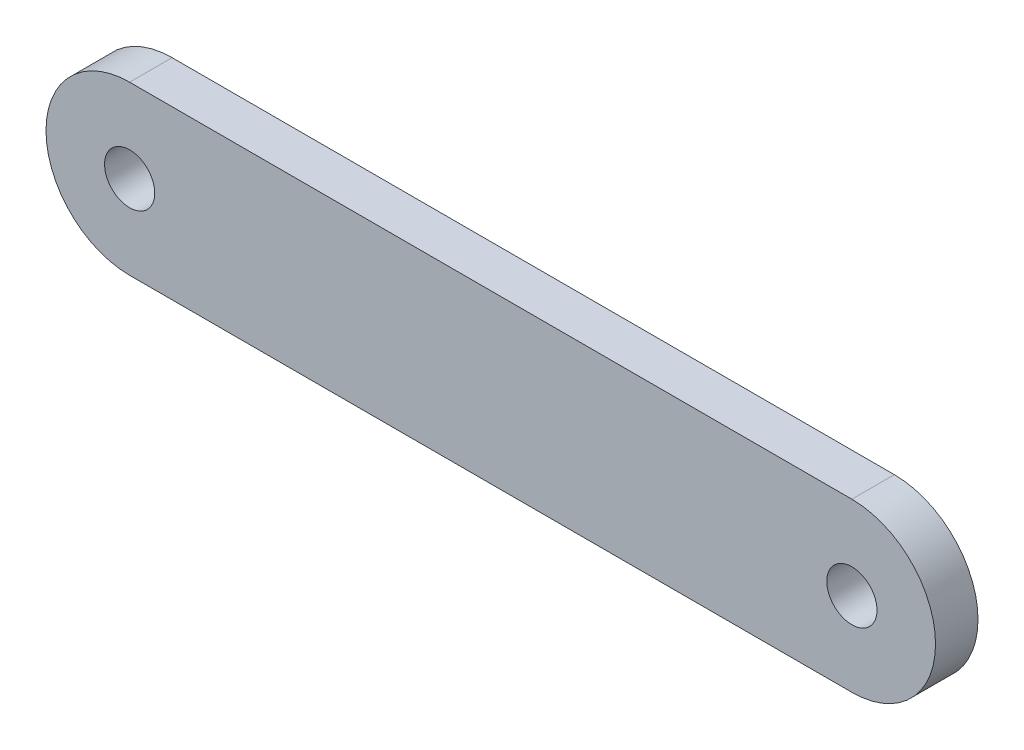
ISO-10303-21;
HEADER;
FILE_DESCRIPTION(('STEP AP214'),'2;1');
FILE_NAME('part.step','',(''),(''),'','','');
FILE_SCHEMA(('AUTOMOTIVE_DESIGN { 1 0 10303 214 1 1 1 1 }'));
ENDSEC;
DATA;
#1=APPLICATION_CONTEXT('core data for automotive mechanical design processes');
#2=APPLICATION_PROTOCOL_DEFINITION('international standard','automotive_design',2000,#1);
#3=PRODUCT_CONTEXT('',#1,'mechanical');
#4=PRODUCT('Part','Part','',(#3));
#5=PRODUCT_RELATED_PRODUCT_CATEGORY('part','',(#4));
#6=PRODUCT_DEFINITION_FORMATION('','',#4);
#7=PRODUCT_DEFINITION_CONTEXT('part definition',#1,'design');
#8=PRODUCT_DEFINITION('design','',#6,#7);
#9=PRODUCT_DEFINITION_SHAPE('','',#8);
#10=(LENGTH_UNIT() NAMED_UNIT(*) SI_UNIT(.MILLI.,.METRE.));
#11=(NAMED_UNIT(*) PLANE_ANGLE_UNIT() SI_UNIT($,.RADIAN.));
#12=(NAMED_UNIT(*) SI_UNIT($,.STERADIAN.) SOLID_ANGLE_UNIT());
#13=UNCERTAINTY_MEASURE_WITH_UNIT(LENGTH_MEASURE(1.E-05),#10,'distance_accuracy_value','');
#14=(GEOMETRIC_REPRESENTATION_CONTEXT(3) GLOBAL_UNCERTAINTY_ASSIGNED_CONTEXT((#13)) GLOBAL_UNIT_ASSIGNED_CONTEXT((#10,
#11,#12)) REPRESENTATION_CONTEXT('',''));
#15=CARTESIAN_POINT('',(0.,0.,0.));
#16=DIRECTION('',(0.,0.,1.));
#17=DIRECTION('',(1.,0.,0.));
#18=AXIS2_PLACEMENT_3D('',#15,#16,#17);
#19=CARTESIAN_POINT('',(-10.795,0.,0.635));
#20=DIRECTION('',(0.,0.,1.));
#21=DIRECTION('',(1.,0.,0.));
#22=AXIS2_PLACEMENT_3D('',#19,#20,#21);
#23=PLANE('',#22);
#24=CARTESIAN_POINT('',(-10.795,0.,0.635));
#25=DIRECTION('',(0.,0.,1.));
#26=DIRECTION('',(1.,0.,0.));
#27=AXIS2_PLACEMENT_3D('',#24,#25,#26);
#28=CIRCLE('',#27,0.75);
#29=CARTESIAN_POINT('',(-10.045,0.,0.635));
#30=VERTEX_POINT('',#29);
#31=EDGE_CURVE('E100',#30,#30,#28,.T.);
#32=ORIENTED_EDGE('',*,*,#31,.F.);
#33=EDGE_LOOP('',(#32));
#34=FACE_BOUND('',#33,.T.);
#35=CARTESIAN_POINT('',(-10.795,0.,0.635));
#36=DIRECTION('',(0.,0.,1.));
#37=DIRECTION('',(1.,0.,0.));
#38=AXIS2_PLACEMENT_3D('',#35,#36,#37);
#39=CIRCLE('',#38,2.5);
#40=CARTESIAN_POINT('',(-10.795,2.5,0.635));
#41=VERTEX_POINT('',#40);
#42=CARTESIAN_POINT('',(-10.795,-2.5,0.635));
#43=VERTEX_POINT('',#42);
#44=EDGE_CURVE('E85',#41,#43,#39,.T.);
#45=ORIENTED_EDGE('',*,*,#44,.T.);
#46=DIRECTION('',(1.,0.,0.));
#47=VECTOR('',#46,1.);
#48=CARTESIAN_POINT('',(-10.795,-2.5,0.635));
#49=LINE('',#48,#47);
#50=CARTESIAN_POINT('',(10.795,-2.5,0.635));
#51=VERTEX_POINT('',#50);
#52=EDGE_CURVE('E80',#43,#51,#49,.T.);
#53=ORIENTED_EDGE('',*,*,#52,.T.);
#54=CARTESIAN_POINT('',(10.795,0.,0.635));
#55=DIRECTION('',(0.,0.,1.));
#56=DIRECTION('',(1.,0.,0.));
#57=AXIS2_PLACEMENT_3D('',#54,#55,#56);
#58=CIRCLE('',#57,2.5);
#59=CARTESIAN_POINT('',(10.795,2.50000000000001,0.635));
#60=VERTEX_POINT('',#59);
#61=EDGE_CURVE('E83',#51,#60,#58,.T.);
#62=ORIENTED_EDGE('',*,*,#61,.T.);
#63=DIRECTION('',(-1.,0.,0.));
#64=VECTOR('',#63,1.);
#65=CARTESIAN_POINT('',(-10.795,2.5,0.635));
#66=LINE('',#65,#64);
#67=EDGE_CURVE('E50',#60,#41,#66,.T.);
#68=ORIENTED_EDGE('',*,*,#67,.T.);
#69=EDGE_LOOP('',(#45,#53,#62,#68));
#70=FACE_BOUND('',#69,.T.);
#71=CARTESIAN_POINT('',(10.795,0.,0.635));
#72=DIRECTION('',(0.,0.,1.));
#73=DIRECTION('',(1.,0.,0.));
#74=AXIS2_PLACEMENT_3D('',#71,#72,#73);
#75=CIRCLE('',#74,0.75);
#76=CARTESIAN_POINT('',(11.545,0.,0.635));
#77=VERTEX_POINT('',#76);
#78=EDGE_CURVE('E115',#77,#77,#75,.T.);
#79=ORIENTED_EDGE('',*,*,#78,.F.);
#80=EDGE_LOOP('',(#79));
#81=FACE_BOUND('',#80,.T.);
#82=ADVANCED_FACE('F33',(#34,#70,#81),#23,.T.);
#83=CARTESIAN_POINT('',(-10.795,0.,-0.635));
#84=DIRECTION('',(0.,0.,1.));
#85=DIRECTION('',(1.,0.,0.));
#86=AXIS2_PLACEMENT_3D('',#83,#84,#85);
#87=PLANE('',#86);
#88=CARTESIAN_POINT('',(-10.795,0.,-0.635));
#89=DIRECTION('',(0.,0.,1.));
#90=DIRECTION('',(1.,0.,0.));
#91=AXIS2_PLACEMENT_3D('',#88,#89,#90);
#92=CIRCLE('',#91,2.5);
#93=CARTESIAN_POINT('',(-10.795,2.5,-0.635));
#94=VERTEX_POINT('',#93);
#95=CARTESIAN_POINT('',(-10.795,-2.5,-0.635));
#96=VERTEX_POINT('',#95);
#97=EDGE_CURVE('E97',#94,#96,#92,.T.);
#98=ORIENTED_EDGE('',*,*,#97,.F.);
#99=DIRECTION('',(-1.,0.,0.));
#100=VECTOR('',#99,1.);
#101=CARTESIAN_POINT('',(-10.795,2.5,-0.635));
#102=LINE('',#101,#100);
#103=CARTESIAN_POINT('',(10.795,2.50000000000001,-0.635));
#104=VERTEX_POINT('',#103);
#105=EDGE_CURVE('E73',#104,#94,#102,.T.);
#106=ORIENTED_EDGE('',*,*,#105,.F.);
#107=CARTESIAN_POINT('',(10.795,0.,-0.635));
#108=DIRECTION('',(0.,0.,1.));
#109=DIRECTION('',(1.,0.,0.));
#110=AXIS2_PLACEMENT_3D('',#107,#108,#109);
#111=CIRCLE('',#110,2.5);
#112=CARTESIAN_POINT('',(10.795,-2.5,-0.635));
#113=VERTEX_POINT('',#112);
#114=EDGE_CURVE('E67',#113,#104,#111,.T.);
#115=ORIENTED_EDGE('',*,*,#114,.F.);
#116=DIRECTION('',(1.,0.,0.));
#117=VECTOR('',#116,1.);
#118=CARTESIAN_POINT('',(-10.795,-2.5,-0.635));
#119=LINE('',#118,#117);
#120=EDGE_CURVE('E89',#96,#113,#119,.T.);
#121=ORIENTED_EDGE('',*,*,#120,.F.);
#122=EDGE_LOOP('',(#98,#106,#115,#121));
#123=FACE_BOUND('',#122,.T.);
#124=CARTESIAN_POINT('',(-10.795,0.,-0.635));
#125=DIRECTION('',(0.,0.,1.));
#126=DIRECTION('',(1.,0.,0.));
#127=AXIS2_PLACEMENT_3D('',#124,#125,#126);
#128=CIRCLE('',#127,0.75);
#129=CARTESIAN_POINT('',(-10.045,0.,-0.635));
#130=VERTEX_POINT('',#129);
#131=EDGE_CURVE('E112',#130,#130,#128,.T.);
#132=ORIENTED_EDGE('',*,*,#131,.T.);
#133=EDGE_LOOP('',(#132));
#134=FACE_BOUND('',#133,.T.);
#135=CARTESIAN_POINT('',(10.795,0.,-0.635));
#136=DIRECTION('',(0.,0.,1.));
#137=DIRECTION('',(1.,0.,0.));
#138=AXIS2_PLACEMENT_3D('',#135,#136,#137);
#139=CIRCLE('',#138,0.75);
#140=CARTESIAN_POINT('',(11.545,0.,-0.635));
#141=VERTEX_POINT('',#140);
#142=EDGE_CURVE('E118',#141,#141,#139,.T.);
#143=ORIENTED_EDGE('',*,*,#142,.T.);
#144=EDGE_LOOP('',(#143));
#145=FACE_BOUND('',#144,.T.);
#146=ADVANCED_FACE('F108',(#123,#134,#145),#87,.F.);
#147=CARTESIAN_POINT('',(-10.795,0.,0.635));
#148=DIRECTION('',(0.,0.,-1.));
#149=DIRECTION('',(-1.,0.,0.));
#150=AXIS2_PLACEMENT_3D('',#147,#148,#149);
#151=CYLINDRICAL_SURFACE('',#150,2.5);
#152=ORIENTED_EDGE('',*,*,#97,.T.);
#153=DIRECTION('',(0.,0.,-1.));
#154=VECTOR('',#153,1.);
#155=CARTESIAN_POINT('',(-10.795,-2.5,0.635));
#156=LINE('',#155,#154);
#157=EDGE_CURVE('E11',#43,#96,#156,.T.);
#158=ORIENTED_EDGE('',*,*,#157,.F.);
#159=ORIENTED_EDGE('',*,*,#44,.F.);
#160=DIRECTION('',(0.,0.,-1.));
#161=VECTOR('',#160,1.);
#162=CARTESIAN_POINT('',(-10.795,2.5,0.635));
#163=LINE('',#162,#161);
#164=EDGE_CURVE('E93',#41,#94,#163,.T.);
#165=ORIENTED_EDGE('',*,*,#164,.T.);
#166=EDGE_LOOP('',(#152,#158,#159,#165));
#167=FACE_BOUND('',#166,.T.);
#168=ADVANCED_FACE('F35',(#167),#151,.T.);
#169=CARTESIAN_POINT('',(-10.795,-2.5,0.635));
#170=DIRECTION('',(0.,1.,0.));
#171=DIRECTION('',(-1.,0.,0.));
#172=AXIS2_PLACEMENT_3D('',#169,#170,#171);
#173=PLANE('',#172);
#174=ORIENTED_EDGE('',*,*,#120,.T.);
#175=DIRECTION('',(0.,0.,-1.));
#176=VECTOR('',#175,1.);
#177=CARTESIAN_POINT('',(10.795,-2.5,0.635));
#178=LINE('',#177,#176);
#179=EDGE_CURVE('E42',#51,#113,#178,.T.);
#180=ORIENTED_EDGE('',*,*,#179,.F.);
#181=ORIENTED_EDGE('',*,*,#52,.F.);
#182=ORIENTED_EDGE('',*,*,#157,.T.);
#183=EDGE_LOOP('',(#174,#180,#181,#182));
#184=FACE_BOUND('',#183,.T.);
#185=ADVANCED_FACE('F88',(#184),#173,.F.);
#186=CARTESIAN_POINT('',(10.795,0.,0.635));
#187=DIRECTION('',(0.,0.,-1.));
#188=DIRECTION('',(-1.,0.,0.));
#189=AXIS2_PLACEMENT_3D('',#186,#187,#188);
#190=CYLINDRICAL_SURFACE('',#189,2.5);
#191=ORIENTED_EDGE('',*,*,#114,.T.);
#192=DIRECTION('',(0.,0.,-1.));
#193=VECTOR('',#192,1.);
#194=CARTESIAN_POINT('',(10.795,2.50000000000001,0.635));
#195=LINE('',#194,#193);
#196=EDGE_CURVE('E90',#60,#104,#195,.T.);
#197=ORIENTED_EDGE('',*,*,#196,.F.);
#198=ORIENTED_EDGE('',*,*,#61,.F.);
#199=ORIENTED_EDGE('',*,*,#179,.T.);
#200=EDGE_LOOP('',(#191,#197,#198,#199));
#201=FACE_BOUND('',#200,.T.);
#202=ADVANCED_FACE('F91',(#201),#190,.T.);
#203=CARTESIAN_POINT('',(-10.795,2.5,0.635));
#204=DIRECTION('',(0.,-1.,0.));
#205=DIRECTION('',(1.,0.,0.));
#206=AXIS2_PLACEMENT_3D('',#203,#204,#205);
#207=PLANE('',#206);
#208=ORIENTED_EDGE('',*,*,#105,.T.);
#209=ORIENTED_EDGE('',*,*,#164,.F.);
#210=ORIENTED_EDGE('',*,*,#67,.F.);
#211=ORIENTED_EDGE('',*,*,#196,.T.);
#212=EDGE_LOOP('',(#208,#209,#210,#211));
#213=FACE_BOUND('',#212,.T.);
#214=ADVANCED_FACE('F105',(#213),#207,.F.);
#215=CARTESIAN_POINT('',(-10.795,0.,0.635));
#216=DIRECTION('',(0.,0.,-1.));
#217=DIRECTION('',(-1.,0.,0.));
#218=AXIS2_PLACEMENT_3D('',#215,#216,#217);
#219=CYLINDRICAL_SURFACE('',#218,0.75);
#220=ORIENTED_EDGE('',*,*,#31,.T.);
#221=EDGE_LOOP('',(#220));
#222=FACE_BOUND('',#221,.T.);
#223=ORIENTED_EDGE('',*,*,#131,.F.);
#224=EDGE_LOOP('',(#223));
#225=FACE_BOUND('',#224,.T.);
#226=ADVANCED_FACE('F135',(#222,#225),#219,.F.);
#227=CARTESIAN_POINT('',(10.795,0.,0.635));
#228=DIRECTION('',(0.,0.,-1.));
#229=DIRECTION('',(-1.,0.,0.));
#230=AXIS2_PLACEMENT_3D('',#227,#228,#229);
#231=CYLINDRICAL_SURFACE('',#230,0.75);
#232=ORIENTED_EDGE('',*,*,#78,.T.);
#233=EDGE_LOOP('',(#232));
#234=FACE_BOUND('',#233,.T.);
#235=ORIENTED_EDGE('',*,*,#142,.F.);
#236=EDGE_LOOP('',(#235));
#237=FACE_BOUND('',#236,.T.);
#238=ADVANCED_FACE('F124',(#234,#237),#231,.F.);
#239=CLOSED_SHELL('',(#82,#146,#168,#185,#202,#214,#226,#238));
#240=MANIFOLD_SOLID_BREP('B2',#239);
#241=ADVANCED_BREP_SHAPE_REPRESENTATION('',(#18,#240),#14);
#242=SHAPE_DEFINITION_REPRESENTATION(#9,#241);
ENDSEC;
END-ISO-10303-21;
